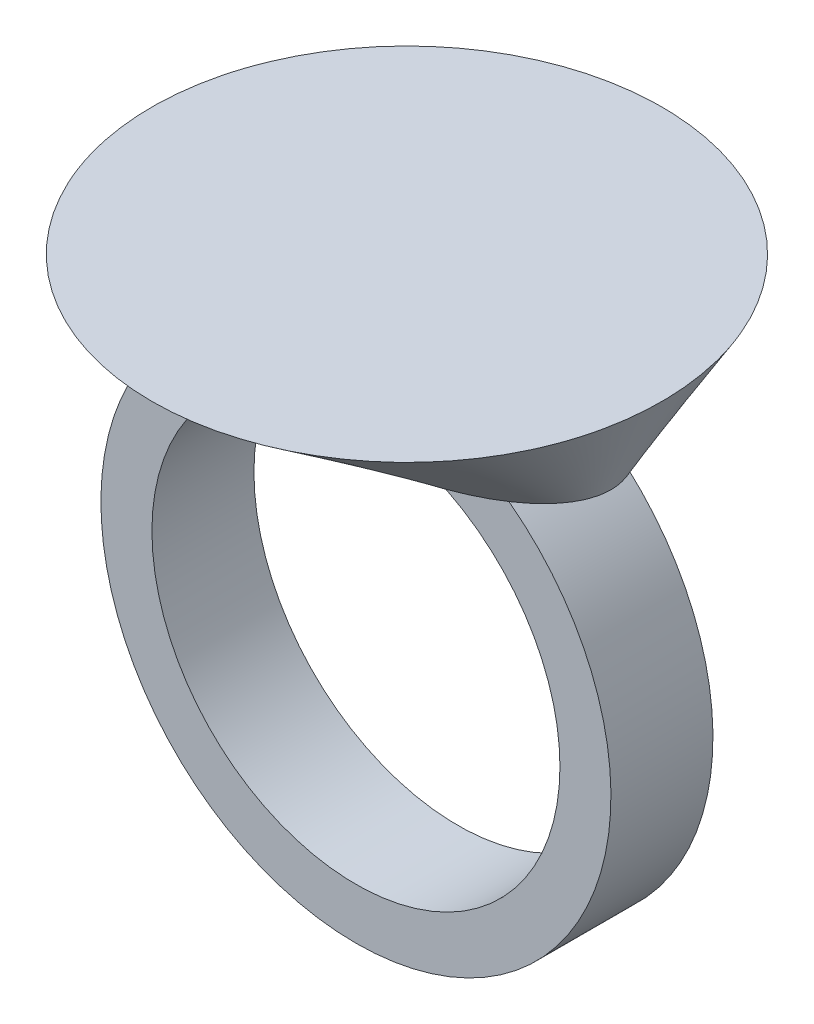
ISO-10303-21;
HEADER;
FILE_DESCRIPTION(('STEP AP214'),'2;1');
FILE_NAME('part.step','',(''),(''),'','','');
FILE_SCHEMA(('AUTOMOTIVE_DESIGN { 1 0 10303 214 1 1 1 1 }'));
ENDSEC;
DATA;
#1=APPLICATION_CONTEXT('core data for automotive mechanical design processes');
#2=APPLICATION_PROTOCOL_DEFINITION('international standard','automotive_design',2000,#1);
#3=PRODUCT_CONTEXT('',#1,'mechanical');
#4=PRODUCT('Part','Part','',(#3));
#5=PRODUCT_RELATED_PRODUCT_CATEGORY('part','',(#4));
#6=PRODUCT_DEFINITION_FORMATION('','',#4);
#7=PRODUCT_DEFINITION_CONTEXT('part definition',#1,'design');
#8=PRODUCT_DEFINITION('design','',#6,#7);
#9=PRODUCT_DEFINITION_SHAPE('','',#8);
#10=(LENGTH_UNIT() NAMED_UNIT(*) SI_UNIT(.MILLI.,.METRE.));
#11=(NAMED_UNIT(*) PLANE_ANGLE_UNIT() SI_UNIT($,.RADIAN.));
#12=(NAMED_UNIT(*) SI_UNIT($,.STERADIAN.) SOLID_ANGLE_UNIT());
#13=UNCERTAINTY_MEASURE_WITH_UNIT(LENGTH_MEASURE(1.E-05),#10,'distance_accuracy_value','');
#14=(GEOMETRIC_REPRESENTATION_CONTEXT(3) GLOBAL_UNCERTAINTY_ASSIGNED_CONTEXT((#13)) GLOBAL_UNIT_ASSIGNED_CONTEXT((#10,
#11,#12)) REPRESENTATION_CONTEXT('',''));
#15=CARTESIAN_POINT('',(0.,0.,0.));
#16=DIRECTION('',(0.,0.,1.));
#17=DIRECTION('',(1.,0.,0.));
#18=AXIS2_PLACEMENT_3D('',#15,#16,#17);
#19=CARTESIAN_POINT('',(0.,0.,5.));
#20=DIRECTION('',(0.,0.,1.));
#21=DIRECTION('',(1.,0.,0.));
#22=AXIS2_PLACEMENT_3D('',#19,#20,#21);
#23=PLANE('',#22);
#24=CARTESIAN_POINT('',(0.,0.,5.));
#25=DIRECTION('',(0.,0.,1.));
#26=DIRECTION('',(1.,0.,0.));
#27=AXIS2_PLACEMENT_3D('',#24,#25,#26);
#28=CIRCLE('',#27,20.);
#29=CARTESIAN_POINT('',(20.,0.,5.));
#30=VERTEX_POINT('',#29);
#31=EDGE_CURVE('E93',#30,#30,#28,.T.);
#32=ORIENTED_EDGE('',*,*,#31,.F.);
#33=EDGE_LOOP('',(#32));
#34=FACE_BOUND('',#33,.T.);
#35=CARTESIAN_POINT('',(0.,0.,5.));
#36=DIRECTION('',(0.,0.,1.));
#37=DIRECTION('',(1.,0.,0.));
#38=AXIS2_PLACEMENT_3D('',#35,#36,#37);
#39=CIRCLE('',#38,25.);
#40=CARTESIAN_POINT('',(-13.5646599662505,21.,5.));
#41=VERTEX_POINT('',#40);
#42=CARTESIAN_POINT('',(13.5646599662505,21.,5.));
#43=VERTEX_POINT('',#42);
#44=EDGE_CURVE('E81',#41,#43,#39,.T.);
#45=ORIENTED_EDGE('',*,*,#44,.T.);
#46=DIRECTION('',(-1.,0.,0.));
#47=VECTOR('',#46,1.);
#48=CARTESIAN_POINT('',(0.,21.,5.));
#49=LINE('',#48,#47);
#50=EDGE_CURVE('E87',#43,#41,#49,.T.);
#51=ORIENTED_EDGE('',*,*,#50,.T.);
#52=EDGE_LOOP('',(#45,#51));
#53=FACE_BOUND('',#52,.T.);
#54=ADVANCED_FACE('F55',(#34,#53),#23,.T.);
#55=CARTESIAN_POINT('',(0.,0.,-5.));
#56=DIRECTION('',(0.,0.,1.));
#57=DIRECTION('',(1.,0.,0.));
#58=AXIS2_PLACEMENT_3D('',#55,#56,#57);
#59=PLANE('',#58);
#60=CARTESIAN_POINT('',(0.,0.,-5.));
#61=DIRECTION('',(0.,0.,1.));
#62=DIRECTION('',(1.,0.,0.));
#63=AXIS2_PLACEMENT_3D('',#60,#61,#62);
#64=CIRCLE('',#63,20.);
#65=CARTESIAN_POINT('',(20.,0.,-5.));
#66=VERTEX_POINT('',#65);
#67=EDGE_CURVE('E89',#66,#66,#64,.T.);
#68=ORIENTED_EDGE('',*,*,#67,.T.);
#69=EDGE_LOOP('',(#68));
#70=FACE_BOUND('',#69,.T.);
#71=DIRECTION('',(-1.,0.,0.));
#72=VECTOR('',#71,1.);
#73=CARTESIAN_POINT('',(0.,21.,-5.));
#74=LINE('',#73,#72);
#75=CARTESIAN_POINT('',(13.5646599662505,21.,-5.));
#76=VERTEX_POINT('',#75);
#77=CARTESIAN_POINT('',(-13.5646599662505,21.,-5.));
#78=VERTEX_POINT('',#77);
#79=EDGE_CURVE('E75',#76,#78,#74,.T.);
#80=ORIENTED_EDGE('',*,*,#79,.F.);
#81=CARTESIAN_POINT('',(0.,0.,-5.));
#82=DIRECTION('',(0.,0.,1.));
#83=DIRECTION('',(1.,0.,0.));
#84=AXIS2_PLACEMENT_3D('',#81,#82,#83);
#85=CIRCLE('',#84,25.);
#86=EDGE_CURVE('E85',#78,#76,#85,.T.);
#87=ORIENTED_EDGE('',*,*,#86,.F.);
#88=EDGE_LOOP('',(#80,#87));
#89=FACE_BOUND('',#88,.T.);
#90=ADVANCED_FACE('F132',(#70,#89),#59,.F.);
#91=CARTESIAN_POINT('',(0.,0.,5.));
#92=DIRECTION('',(0.,0.,-1.));
#93=DIRECTION('',(-1.,0.,0.));
#94=AXIS2_PLACEMENT_3D('',#91,#92,#93);
#95=CYLINDRICAL_SURFACE('',#94,25.);
#96=DIRECTION('',(0.,0.,-1.));
#97=VECTOR('',#96,1.);
#98=CARTESIAN_POINT('',(13.5646599662505,21.,5.));
#99=LINE('',#98,#97);
#100=EDGE_CURVE('E13',#43,#76,#99,.T.);
#101=ORIENTED_EDGE('',*,*,#100,.F.);
#102=ORIENTED_EDGE('',*,*,#44,.F.);
#103=DIRECTION('',(0.,0.,-1.));
#104=VECTOR('',#103,1.);
#105=CARTESIAN_POINT('',(-13.5646599662505,21.,5.));
#106=LINE('',#105,#104);
#107=EDGE_CURVE('E63',#78,#41,#106,.F.);
#108=ORIENTED_EDGE('',*,*,#107,.F.);
#109=ORIENTED_EDGE('',*,*,#86,.T.);
#110=EDGE_LOOP('',(#101,#102,#108,#109));
#111=FACE_BOUND('',#110,.T.);
#112=ADVANCED_FACE('F57',(#111),#95,.T.);
#113=CARTESIAN_POINT('',(0.,0.,5.));
#114=DIRECTION('',(0.,0.,-1.));
#115=DIRECTION('',(-1.,0.,0.));
#116=AXIS2_PLACEMENT_3D('',#113,#114,#115);
#117=CYLINDRICAL_SURFACE('',#116,20.);
#118=ORIENTED_EDGE('',*,*,#31,.T.);
#119=EDGE_LOOP('',(#118));
#120=FACE_BOUND('',#119,.T.);
#121=ORIENTED_EDGE('',*,*,#67,.F.);
#122=EDGE_LOOP('',(#121));
#123=FACE_BOUND('',#122,.T.);
#124=ADVANCED_FACE('F127',(#120,#123),#117,.F.);
#125=CARTESIAN_POINT('',(0.,21.,0.));
#126=DIRECTION('',(0.,1.,0.));
#127=DIRECTION('',(0.,0.,1.));
#128=AXIS2_PLACEMENT_3D('',#125,#126,#127);
#129=PLANE('',#128);
#130=CARTESIAN_POINT('',(0.,21.,0.));
#131=DIRECTION('',(0.,1.,0.));
#132=DIRECTION('',(1.,0.,0.));
#133=AXIS2_PLACEMENT_3D('',#130,#131,#132);
#134=ELLIPSE('',#133,20.,10.);
#135=CARTESIAN_POINT('',(20.,21.,0.));
#136=VERTEX_POINT('',#135);
#137=EDGE_CURVE('E100',#136,#136,#134,.T.);
#138=ORIENTED_EDGE('',*,*,#137,.F.);
#139=EDGE_LOOP('',(#138));
#140=FACE_BOUND('',#139,.T.);
#141=ORIENTED_EDGE('',*,*,#50,.F.);
#142=ORIENTED_EDGE('',*,*,#100,.T.);
#143=ORIENTED_EDGE('',*,*,#79,.T.);
#144=ORIENTED_EDGE('',*,*,#107,.T.);
#145=EDGE_LOOP('',(#141,#142,#143,#144));
#146=FACE_BOUND('',#145,.T.);
#147=ADVANCED_FACE('F91',(#140,#146),#129,.F.);
#148=CARTESIAN_POINT('',(0.,31.,0.));
#149=DIRECTION('',(0.,1.,0.));
#150=DIRECTION('',(0.,0.,1.));
#151=AXIS2_PLACEMENT_3D('',#148,#149,#150);
#152=PLANE('',#151);
#153=CARTESIAN_POINT('',(0.,31.,0.));
#154=DIRECTION('',(0.,1.,0.));
#155=DIRECTION('',(0.,0.,1.));
#156=AXIS2_PLACEMENT_3D('',#153,#154,#155);
#157=CIRCLE('',#156,25.);
#158=CARTESIAN_POINT('',(0.,31.,25.));
#159=VERTEX_POINT('',#158);
#160=EDGE_CURVE('E103',#159,#159,#157,.T.);
#161=ORIENTED_EDGE('',*,*,#160,.T.);
#162=EDGE_LOOP('',(#161));
#163=FACE_BOUND('',#162,.T.);
#164=ADVANCED_FACE('F111',(#163),#152,.T.);
#165=CARTESIAN_POINT('',(-20.,21.,0.));
#166=CARTESIAN_POINT('',(-21.6666666666667,24.3333333333333,0.));
#167=CARTESIAN_POINT('',(-23.3333333333333,27.6666666666667,0.));
#168=CARTESIAN_POINT('',(-25.,31.,0.));
#169=CARTESIAN_POINT('',(-20.,21.,0.275957504961547));
#170=CARTESIAN_POINT('',(-21.6666666666667,24.3333333333333,0.413936257442319));
#171=CARTESIAN_POINT('',(-23.3333333333333,27.6666666666667,0.551915009923092));
#172=CARTESIAN_POINT('',(-25.,31.,0.689893762403865));
#173=CARTESIAN_POINT('',(-19.9551915009923,21.,0.822681013892335));
#174=CARTESIAN_POINT('',(-21.618124126075,24.3333333333333,1.2340215208385));
#175=CARTESIAN_POINT('',(-23.2810567511577,27.6666666666667,1.64536202778467));
#176=CARTESIAN_POINT('',(-24.9439893762404,31.,2.05670253473084));
#177=CARTESIAN_POINT('',(-19.7587170800112,21.,1.62460986203486));
#178=CARTESIAN_POINT('',(-21.4052768366788,24.3333333333333,2.43691479305229));
#179=CARTESIAN_POINT('',(-23.0518365933464,27.6666666666667,3.24921972406972));
#180=CARTESIAN_POINT('',(-24.698396350014,31.,4.06152465508715));
#181=CARTESIAN_POINT('',(-19.4381448111139,21.,2.405800382647));
#182=CARTESIAN_POINT('',(-21.05799021204,24.3333333333333,3.6087005739705));
#183=CARTESIAN_POINT('',(-22.6778356129662,27.6666666666667,4.811600765294));
#184=CARTESIAN_POINT('',(-24.2976810138923,31.,6.0145009566175));
#185=CARTESIAN_POINT('',(-16.801107057554,21.,6.95302206747708));
#186=CARTESIAN_POINT('',(-18.2011993123501,24.3333333333333,10.4295331012156));
#187=CARTESIAN_POINT('',(-19.6012915671463,27.6666666666667,13.9060441349542));
#188=CARTESIAN_POINT('',(-21.0013838219425,31.,17.3825551686927));
#189=CARTESIAN_POINT('',(-8.8306401587696,21.,10.));
#190=CARTESIAN_POINT('',(-9.56652683866707,24.3333333333333,15.));
#191=CARTESIAN_POINT('',(-10.3024135185645,27.6666666666667,20.));
#192=CARTESIAN_POINT('',(-11.038300198462,31.,25.));
#193=CARTESIAN_POINT('',(11.038300198462,21.,10.));
#194=CARTESIAN_POINT('',(11.9581585483338,24.3333333333333,15.));
#195=CARTESIAN_POINT('',(12.8780168982057,27.6666666666667,20.));
#196=CARTESIAN_POINT('',(13.7978752480775,31.,25.));
#197=CARTESIAN_POINT('',(20.,21.,5.519150099231));
#198=CARTESIAN_POINT('',(21.6666666666667,24.3333333333333,8.2787251488465));
#199=CARTESIAN_POINT('',(23.3333333333333,27.6666666666667,11.038300198462));
#200=CARTESIAN_POINT('',(25.,31.,13.7978752480775));
#201=CARTESIAN_POINT('',(20.,21.,-5.519150099231));
#202=CARTESIAN_POINT('',(21.6666666666667,24.3333333333333,-8.2787251488465));
#203=CARTESIAN_POINT('',(23.3333333333333,27.6666666666667,-11.038300198462));
#204=CARTESIAN_POINT('',(25.,31.,-13.7978752480775));
#205=CARTESIAN_POINT('',(11.038300198462,21.,-10.));
#206=CARTESIAN_POINT('',(11.9581585483338,24.3333333333333,-15.));
#207=CARTESIAN_POINT('',(12.8780168982057,27.6666666666667,-20.));
#208=CARTESIAN_POINT('',(13.7978752480775,31.,-25.));
#209=CARTESIAN_POINT('',(-8.83064015876959,21.,-10.));
#210=CARTESIAN_POINT('',(-9.56652683866706,24.3333333333333,-15.));
#211=CARTESIAN_POINT('',(-10.3024135185645,27.6666666666667,-20.));
#212=CARTESIAN_POINT('',(-11.038300198462,31.,-25.));
#213=CARTESIAN_POINT('',(-16.801107057554,21.,-6.95302206747708));
#214=CARTESIAN_POINT('',(-18.2011993123501,24.3333333333333,-10.4295331012156));
#215=CARTESIAN_POINT('',(-19.6012915671463,27.6666666666667,-13.9060441349542));
#216=CARTESIAN_POINT('',(-21.0013838219425,31.,-17.3825551686927));
#217=CARTESIAN_POINT('',(-19.4381448111139,21.,-2.405800382647));
#218=CARTESIAN_POINT('',(-21.05799021204,24.3333333333333,-3.6087005739705));
#219=CARTESIAN_POINT('',(-22.6778356129662,27.6666666666667,-4.81160076529401));
#220=CARTESIAN_POINT('',(-24.2976810138923,31.,-6.01450095661751));
#221=CARTESIAN_POINT('',(-19.7587170800112,21.,-1.62460986203487));
#222=CARTESIAN_POINT('',(-21.4052768366788,24.3333333333333,-2.4369147930523));
#223=CARTESIAN_POINT('',(-23.0518365933464,27.6666666666667,-3.24921972406973));
#224=CARTESIAN_POINT('',(-24.698396350014,31.,-4.06152465508717));
#225=CARTESIAN_POINT('',(-19.9551915009923,21.,-0.822681013892343));
#226=CARTESIAN_POINT('',(-21.618124126075,24.3333333333333,-1.23402152083851));
#227=CARTESIAN_POINT('',(-23.2810567511577,27.6666666666667,-1.64536202778469));
#228=CARTESIAN_POINT('',(-24.9439893762404,31.,-2.05670253473086));
#229=CARTESIAN_POINT('',(-20.,21.,-0.275957504961552));
#230=CARTESIAN_POINT('',(-21.6666666666667,24.3333333333333,-0.413936257442328));
#231=CARTESIAN_POINT('',(-23.3333333333333,27.6666666666667,-0.551915009923104));
#232=CARTESIAN_POINT('',(-25.,31.,-0.689893762403881));
#233=CARTESIAN_POINT('',(-20.,21.,0.));
#234=CARTESIAN_POINT('',(-21.6666666666667,24.3333333333333,0.));
#235=CARTESIAN_POINT('',(-23.3333333333333,27.6666666666667,0.));
#236=CARTESIAN_POINT('',(-25.,31.,0.));
#237=B_SPLINE_SURFACE_WITH_KNOTS('',3,3,((#165,#166,#167,#168),(#169,#170,#171,#172),(#173,#174,
#175,#176),(#177,#178,#179,#180),(#181,#182,#183,#184),(#185,#186,#187,#188),(#189,#190,#191,
#192),(#193,#194,#195,#196),(#197,#198,#199,#200),(#201,#202,#203,#204),(#205,#206,#207,#208),
(#209,#210,#211,#212),(#213,#214,#215,#216),(#217,#218,#219,#220),(#221,#222,#223,#224),(#225,
#226,#227,#228),(#229,#230,#231,#232),(#233,#234,#235,#236)),.UNSPECIFIED.,.T.,.F.,.F.,(4,1,1,1,
1,2,2,2,1,1,1,1,4),(4,4),(0.,0.0125,0.0249999999999999,0.0375000000000001,0.05,0.25,0.5,0.75,
0.95,0.9625,0.975,0.9875,1.),(0.,1.),.UNSPECIFIED.);
#238=CARTESIAN_POINT('',(-19.9999525,20.999905,0.));
#239=CARTESIAN_POINT('',(-19.9999683333333,20.9999366666667,0.));
#240=CARTESIAN_POINT('',(-19.9999841666667,20.9999683333333,0.));
#241=CARTESIAN_POINT('',(-20.,21.,0.));
#242=CARTESIAN_POINT('',(-21.6666666666667,24.3333333333333,0.));
#243=CARTESIAN_POINT('',(-23.3333333333333,27.6666666666667,0.));
#244=CARTESIAN_POINT('',(-25.,31.,0.));
#245=CARTESIAN_POINT('',(-19.9999525,20.999905,0.275953572567101));
#246=CARTESIAN_POINT('',(-19.9999683333333,20.9999366666667,0.275954883365249));
#247=CARTESIAN_POINT('',(-19.9999841666667,20.9999683333333,0.275956194163398));
#248=CARTESIAN_POINT('',(-20.,21.,0.275957504961547));
#249=CARTESIAN_POINT('',(-21.6666666666667,24.3333333333333,0.413936257442319));
#250=CARTESIAN_POINT('',(-23.3333333333333,27.6666666666667,0.551915009923092));
#251=CARTESIAN_POINT('',(-25.,31.,0.689893762403865));
#252=CARTESIAN_POINT('',(-19.9551441074125,20.999905,0.822669290687887));
#253=CARTESIAN_POINT('',(-19.9551599052724,20.9999366666667,0.822673198422703));
#254=CARTESIAN_POINT('',(-19.9551757031324,20.9999683333333,0.822677106157519));
#255=CARTESIAN_POINT('',(-19.9551915009923,21.,0.822681013892335));
#256=CARTESIAN_POINT('',(-21.618124126075,24.3333333333333,1.2340215208385));
#257=CARTESIAN_POINT('',(-23.2810567511577,27.6666666666667,1.64536202778467));
#258=CARTESIAN_POINT('',(-24.9439893762404,31.,2.05670253473084));
#259=CARTESIAN_POINT('',(-19.7586701530581,20.999905,1.62458671134433));
#260=CARTESIAN_POINT('',(-19.7586857953758,20.9999366666667,1.62459442824117));
#261=CARTESIAN_POINT('',(-19.7587014376935,20.9999683333333,1.62460214513802));
#262=CARTESIAN_POINT('',(-19.7587170800112,21.,1.62460986203486));
#263=CARTESIAN_POINT('',(-21.4052768366788,24.3333333333333,2.43691479305229));
#264=CARTESIAN_POINT('',(-23.0518365933464,27.6666666666667,3.24921972406972));
#265=CARTESIAN_POINT('',(-24.698396350014,31.,4.06152465508715));
#266=CARTESIAN_POINT('',(-19.4380986455199,20.999905,2.40576609999155));
#267=CARTESIAN_POINT('',(-19.4381140340513,20.9999366666667,2.40577752754336));
#268=CARTESIAN_POINT('',(-19.4381294225826,20.9999683333333,2.40578895509518));
#269=CARTESIAN_POINT('',(-19.4381448111139,21.,2.405800382647));
#270=CARTESIAN_POINT('',(-21.05799021204,24.3333333333333,3.6087005739705));
#271=CARTESIAN_POINT('',(-22.6778356129662,27.6666666666667,4.811600765294));
#272=CARTESIAN_POINT('',(-24.2976810138923,31.,6.0145009566175));
#273=CARTESIAN_POINT('',(-16.8010671549247,20.999905,6.95292298691262));
#274=CARTESIAN_POINT('',(-16.8010804558011,20.9999366666667,6.95295601376744));
#275=CARTESIAN_POINT('',(-16.8010937566776,20.9999683333333,6.95298904062226));
#276=CARTESIAN_POINT('',(-16.801107057554,21.,6.95302206747708));
#277=CARTESIAN_POINT('',(-18.2011993123501,24.3333333333333,10.4295331012156));
#278=CARTESIAN_POINT('',(-19.6012915671463,27.6666666666667,13.9060441349542));
#279=CARTESIAN_POINT('',(-21.0013838219425,31.,17.3825551686927));
#280=CARTESIAN_POINT('',(-8.83061918599923,20.999905,9.9998575));
#281=CARTESIAN_POINT('',(-8.83062617692269,20.9999366666667,9.999905));
#282=CARTESIAN_POINT('',(-8.83063316784614,20.9999683333333,9.9999525));
#283=CARTESIAN_POINT('',(-8.8306401587696,21.,10.));
#284=CARTESIAN_POINT('',(-9.56652683866707,24.3333333333333,15.));
#285=CARTESIAN_POINT('',(-10.3024135185645,27.6666666666667,20.));
#286=CARTESIAN_POINT('',(-11.038300198462,31.,25.));
#287=CARTESIAN_POINT('',(11.038273982499,20.999905,9.9998575));
#288=CARTESIAN_POINT('',(11.0382827211534,20.9999366666667,9.999905));
#289=CARTESIAN_POINT('',(11.0382914598077,20.9999683333333,9.9999525));
#290=CARTESIAN_POINT('',(11.038300198462,21.,10.));
#291=CARTESIAN_POINT('',(11.9581585483338,24.3333333333333,15.));
#292=CARTESIAN_POINT('',(12.8780168982057,27.6666666666667,20.));
#293=CARTESIAN_POINT('',(13.7978752480775,31.,25.));
#294=CARTESIAN_POINT('',(19.9999525,20.999905,5.51907145134209));
#295=CARTESIAN_POINT('',(19.9999683333333,20.9999366666667,5.51909766730506));
#296=CARTESIAN_POINT('',(19.9999841666667,20.9999683333333,5.51912388326803));
#297=CARTESIAN_POINT('',(20.,21.,5.519150099231));
#298=CARTESIAN_POINT('',(21.6666666666667,24.3333333333333,8.2787251488465));
#299=CARTESIAN_POINT('',(23.3333333333333,27.6666666666667,11.038300198462));
#300=CARTESIAN_POINT('',(25.,31.,13.7978752480775));
#301=CARTESIAN_POINT('',(19.9999525,20.999905,-5.51907145134208));
#302=CARTESIAN_POINT('',(19.9999683333333,20.9999366666667,-5.51909766730506));
#303=CARTESIAN_POINT('',(19.9999841666667,20.9999683333333,-5.51912388326803));
#304=CARTESIAN_POINT('',(20.,21.,-5.519150099231));
#305=CARTESIAN_POINT('',(21.6666666666667,24.3333333333333,-8.2787251488465));
#306=CARTESIAN_POINT('',(23.3333333333333,27.6666666666667,-11.038300198462));
#307=CARTESIAN_POINT('',(25.,31.,-13.7978752480775));
#308=CARTESIAN_POINT('',(11.038273982499,20.999905,-9.9998575));
#309=CARTESIAN_POINT('',(11.0382827211534,20.9999366666667,-9.999905));
#310=CARTESIAN_POINT('',(11.0382914598077,20.9999683333333,-9.9999525));
#311=CARTESIAN_POINT('',(11.038300198462,21.,-10.));
#312=CARTESIAN_POINT('',(11.9581585483338,24.3333333333333,-15.));
#313=CARTESIAN_POINT('',(12.8780168982057,27.6666666666667,-20.));
#314=CARTESIAN_POINT('',(13.7978752480775,31.,-25.));
#315=CARTESIAN_POINT('',(-8.83061918599922,20.999905,-9.9998575));
#316=CARTESIAN_POINT('',(-8.83062617692268,20.9999366666667,-9.999905));
#317=CARTESIAN_POINT('',(-8.83063316784614,20.9999683333333,-9.9999525));
#318=CARTESIAN_POINT('',(-8.83064015876959,21.,-10.));
#319=CARTESIAN_POINT('',(-9.56652683866706,24.3333333333333,-15.));
#320=CARTESIAN_POINT('',(-10.3024135185645,27.6666666666667,-20.));
#321=CARTESIAN_POINT('',(-11.038300198462,31.,-25.));
#322=CARTESIAN_POINT('',(-16.8010671549247,20.999905,-6.95292298691262));
#323=CARTESIAN_POINT('',(-16.8010804558011,20.9999366666667,-6.95295601376744));
#324=CARTESIAN_POINT('',(-16.8010937566776,20.9999683333333,-6.95298904062226));
#325=CARTESIAN_POINT('',(-16.801107057554,21.,-6.95302206747708));
#326=CARTESIAN_POINT('',(-18.2011993123501,24.3333333333333,-10.4295331012156));
#327=CARTESIAN_POINT('',(-19.6012915671463,27.6666666666667,-13.9060441349542));
#328=CARTESIAN_POINT('',(-21.0013838219425,31.,-17.3825551686927));
#329=CARTESIAN_POINT('',(-19.4380986455199,20.999905,-2.40576609999155));
#330=CARTESIAN_POINT('',(-19.4381140340512,20.9999366666667,-2.40577752754337));
#331=CARTESIAN_POINT('',(-19.4381294225826,20.9999683333333,-2.40578895509519));
#332=CARTESIAN_POINT('',(-19.4381448111139,21.,-2.405800382647));
#333=CARTESIAN_POINT('',(-21.05799021204,24.3333333333333,-3.6087005739705));
#334=CARTESIAN_POINT('',(-22.6778356129662,27.6666666666667,-4.81160076529401));
#335=CARTESIAN_POINT('',(-24.2976810138923,31.,-6.01450095661751));
#336=CARTESIAN_POINT('',(-19.7586701530581,20.999905,-1.62458671134433));
#337=CARTESIAN_POINT('',(-19.7586857953758,20.9999366666667,-1.62459442824118));
#338=CARTESIAN_POINT('',(-19.7587014376935,20.9999683333333,-1.62460214513802));
#339=CARTESIAN_POINT('',(-19.7587170800112,21.,-1.62460986203487));
#340=CARTESIAN_POINT('',(-21.4052768366788,24.3333333333333,-2.4369147930523));
#341=CARTESIAN_POINT('',(-23.0518365933464,27.6666666666667,-3.24921972406973));
#342=CARTESIAN_POINT('',(-24.698396350014,31.,-4.06152465508717));
#343=CARTESIAN_POINT('',(-19.9551441074125,20.999905,-0.822669290687895));
#344=CARTESIAN_POINT('',(-19.9551599052724,20.9999366666667,-0.822673198422711));
#345=CARTESIAN_POINT('',(-19.9551757031324,20.9999683333333,-0.822677106157527));
#346=CARTESIAN_POINT('',(-19.9551915009923,21.,-0.822681013892343));
#347=CARTESIAN_POINT('',(-21.618124126075,24.3333333333333,-1.23402152083851));
#348=CARTESIAN_POINT('',(-23.2810567511577,27.6666666666667,-1.64536202778469));
#349=CARTESIAN_POINT('',(-24.9439893762404,31.,-2.05670253473086));
#350=CARTESIAN_POINT('',(-19.9999525,20.999905,-0.275953572567106));
#351=CARTESIAN_POINT('',(-19.9999683333333,20.9999366666667,-0.275954883365255));
#352=CARTESIAN_POINT('',(-19.9999841666667,20.9999683333333,-0.275956194163403));
#353=CARTESIAN_POINT('',(-20.,21.,-0.275957504961552));
#354=CARTESIAN_POINT('',(-21.6666666666667,24.3333333333333,-0.413936257442328));
#355=CARTESIAN_POINT('',(-23.3333333333333,27.6666666666667,-0.551915009923104));
#356=CARTESIAN_POINT('',(-25.,31.,-0.689893762403881));
#357=CARTESIAN_POINT('',(-19.9999525,20.999905,0.));
#358=CARTESIAN_POINT('',(-19.9999683333333,20.9999366666667,0.));
#359=CARTESIAN_POINT('',(-19.9999841666667,20.9999683333333,0.));
#360=CARTESIAN_POINT('',(-20.,21.,0.));
#361=CARTESIAN_POINT('',(-21.6666666666667,24.3333333333333,0.));
#362=CARTESIAN_POINT('',(-23.3333333333333,27.6666666666667,0.));
#363=CARTESIAN_POINT('',(-25.,31.,0.));
#364=B_SPLINE_SURFACE_WITH_KNOTS('',3,3,((#238,#239,#240,#241,#242,#243,#244),(#245,#246,#247,
#248,#249,#250,#251),(#252,#253,#254,#255,#256,#257,#258),(#259,#260,#261,#262,#263,#264,#265),
(#266,#267,#268,#269,#270,#271,#272),(#273,#274,#275,#276,#277,#278,#279),(#280,#281,#282,#283,
#284,#285,#286),(#287,#288,#289,#290,#291,#292,#293),(#294,#295,#296,#297,#298,#299,#300),(#301,
#302,#303,#304,#305,#306,#307),(#308,#309,#310,#311,#312,#313,#314),(#315,#316,#317,#318,#319,
#320,#321),(#322,#323,#324,#325,#326,#327,#328),(#329,#330,#331,#332,#333,#334,#335),(#336,#337,
#338,#339,#340,#341,#342),(#343,#344,#345,#346,#347,#348,#349),(#350,#351,#352,#353,#354,#355,
#356),(#357,#358,#359,#360,#361,#362,#363)),.UNSPECIFIED.,.T.,.F.,.F.,(4,1,1,1,1,2,2,2,1,1,1,1,
4),(4,3,4),(0.,0.0125,0.0249999999999999,0.0375000000000001,0.05,0.25,0.5,0.75,0.95,0.9625,
0.975,0.9875,1.),(-9.5E-06,0.,1.),.UNSPECIFIED.);
#365=ORIENTED_EDGE('',*,*,#137,.T.);
#366=EDGE_LOOP('',(#365));
#367=FACE_BOUND('',#366,.T.);
#368=ORIENTED_EDGE('',*,*,#160,.F.);
#369=EDGE_LOOP('',(#368));
#370=FACE_BOUND('',#369,.T.);
#371=ADVANCED_FACE('F121',(#367,#370),#364,.T.);
#372=CLOSED_SHELL('',(#54,#90,#112,#124,#147,#164,#371));
#373=MANIFOLD_SOLID_BREP('B2',#372);
#374=ADVANCED_BREP_SHAPE_REPRESENTATION('',(#18,#373),#14);
#375=SHAPE_DEFINITION_REPRESENTATION(#9,#374);
ENDSEC;
END-ISO-10303-21;
